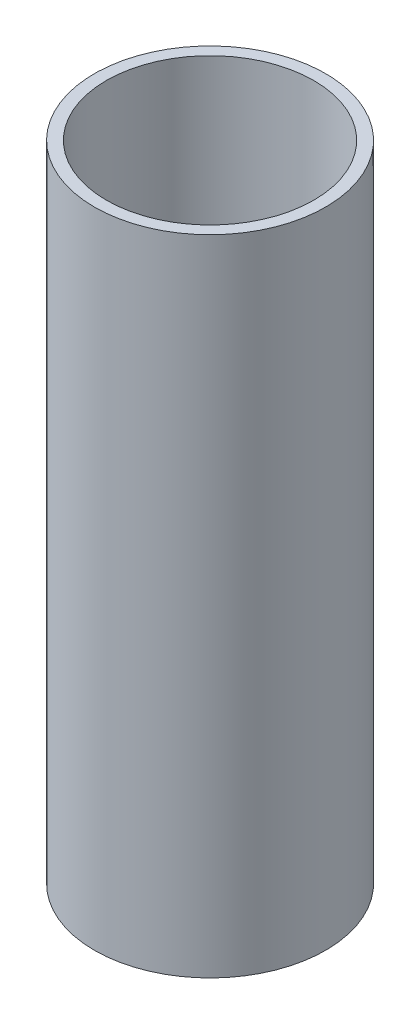
ISO-10303-21;
HEADER;
FILE_DESCRIPTION(('STEP AP214'),'2;1');
FILE_NAME('part.step','',(''),(''),'','','');
FILE_SCHEMA(('AUTOMOTIVE_DESIGN { 1 0 10303 214 1 1 1 1 }'));
ENDSEC;
DATA;
#1=APPLICATION_CONTEXT('core data for automotive mechanical design processes');
#2=APPLICATION_PROTOCOL_DEFINITION('international standard','automotive_design',2000,#1);
#3=PRODUCT_CONTEXT('',#1,'mechanical');
#4=PRODUCT('Part','Part','',(#3));
#5=PRODUCT_RELATED_PRODUCT_CATEGORY('part','',(#4));
#6=PRODUCT_DEFINITION_FORMATION('','',#4);
#7=PRODUCT_DEFINITION_CONTEXT('part definition',#1,'design');
#8=PRODUCT_DEFINITION('design','',#6,#7);
#9=PRODUCT_DEFINITION_SHAPE('','',#8);
#10=(LENGTH_UNIT() NAMED_UNIT(*) SI_UNIT(.MILLI.,.METRE.));
#11=(NAMED_UNIT(*) PLANE_ANGLE_UNIT() SI_UNIT($,.RADIAN.));
#12=(NAMED_UNIT(*) SI_UNIT($,.STERADIAN.) SOLID_ANGLE_UNIT());
#13=UNCERTAINTY_MEASURE_WITH_UNIT(LENGTH_MEASURE(1.E-05),#10,'distance_accuracy_value','');
#14=(GEOMETRIC_REPRESENTATION_CONTEXT(3) GLOBAL_UNCERTAINTY_ASSIGNED_CONTEXT((#13)) GLOBAL_UNIT_ASSIGNED_CONTEXT((#10,
#11,#12)) REPRESENTATION_CONTEXT('',''));
#15=CARTESIAN_POINT('',(0.,0.,0.));
#16=DIRECTION('',(0.,0.,1.));
#17=DIRECTION('',(1.,0.,0.));
#18=AXIS2_PLACEMENT_3D('',#15,#16,#17);
#19=CARTESIAN_POINT('',(0.,306.200191863383,0.));
#20=DIRECTION('',(0.,-1.,0.));
#21=DIRECTION('',(0.,0.,-1.));
#22=AXIS2_PLACEMENT_3D('',#19,#20,#21);
#23=CYLINDRICAL_SURFACE('',#22,55.);
#24=CARTESIAN_POINT('',(0.,306.200191863383,0.));
#25=DIRECTION('',(0.,1.,0.));
#26=DIRECTION('',(0.,0.,1.));
#27=AXIS2_PLACEMENT_3D('',#24,#25,#26);
#28=CIRCLE('',#27,55.);
#29=CARTESIAN_POINT('',(0.,306.200191863383,55.));
#30=VERTEX_POINT('',#29);
#31=EDGE_CURVE('E10',#30,#30,#28,.T.);
#32=ORIENTED_EDGE('',*,*,#31,.F.);
#33=EDGE_LOOP('',(#32));
#34=FACE_BOUND('',#33,.T.);
#35=CARTESIAN_POINT('',(0.,0.,0.));
#36=DIRECTION('',(0.,1.,0.));
#37=DIRECTION('',(0.,0.,1.));
#38=AXIS2_PLACEMENT_3D('',#35,#36,#37);
#39=CIRCLE('',#38,55.);
#40=CARTESIAN_POINT('',(0.,0.,55.));
#41=VERTEX_POINT('',#40);
#42=EDGE_CURVE('E37',#41,#41,#39,.T.);
#43=ORIENTED_EDGE('',*,*,#42,.T.);
#44=EDGE_LOOP('',(#43));
#45=FACE_BOUND('',#44,.T.);
#46=ADVANCED_FACE('F40',(#34,#45),#23,.T.);
#47=CARTESIAN_POINT('',(0.,306.200191863383,0.));
#48=DIRECTION('',(0.,1.,0.));
#49=DIRECTION('',(0.,0.,1.));
#50=AXIS2_PLACEMENT_3D('',#47,#48,#49);
#51=PLANE('',#50);
#52=CARTESIAN_POINT('',(0.,306.200191863383,0.));
#53=DIRECTION('',(0.,1.,0.));
#54=DIRECTION('',(0.,0.,1.));
#55=AXIS2_PLACEMENT_3D('',#52,#53,#54);
#56=CIRCLE('',#55,49.3352893261121);
#57=CARTESIAN_POINT('',(0.,306.200191863383,49.3352893261121));
#58=VERTEX_POINT('',#57);
#59=EDGE_CURVE('E50',#58,#58,#56,.T.);
#60=ORIENTED_EDGE('',*,*,#59,.F.);
#61=EDGE_LOOP('',(#60));
#62=FACE_BOUND('',#61,.T.);
#63=ORIENTED_EDGE('',*,*,#31,.T.);
#64=EDGE_LOOP('',(#63));
#65=FACE_BOUND('',#64,.T.);
#66=ADVANCED_FACE('F59',(#62,#65),#51,.T.);
#67=CARTESIAN_POINT('',(0.,0.,0.));
#68=DIRECTION('',(0.,1.,0.));
#69=DIRECTION('',(0.,0.,1.));
#70=AXIS2_PLACEMENT_3D('',#67,#68,#69);
#71=PLANE('',#70);
#72=CARTESIAN_POINT('',(0.,0.,0.));
#73=DIRECTION('',(0.,1.,0.));
#74=DIRECTION('',(0.,0.,1.));
#75=AXIS2_PLACEMENT_3D('',#72,#73,#74);
#76=CIRCLE('',#75,49.3352893261121);
#77=CARTESIAN_POINT('',(0.,0.,49.3352893261121));
#78=VERTEX_POINT('',#77);
#79=EDGE_CURVE('E47',#78,#78,#76,.T.);
#80=ORIENTED_EDGE('',*,*,#79,.T.);
#81=EDGE_LOOP('',(#80));
#82=FACE_BOUND('',#81,.T.);
#83=ORIENTED_EDGE('',*,*,#42,.F.);
#84=EDGE_LOOP('',(#83));
#85=FACE_BOUND('',#84,.T.);
#86=ADVANCED_FACE('F58',(#82,#85),#71,.F.);
#87=CARTESIAN_POINT('',(0.,306.200191863383,0.));
#88=DIRECTION('',(0.,-1.,0.));
#89=DIRECTION('',(0.,0.,-1.));
#90=AXIS2_PLACEMENT_3D('',#87,#88,#89);
#91=CYLINDRICAL_SURFACE('',#90,49.3352893261121);
#92=ORIENTED_EDGE('',*,*,#59,.T.);
#93=EDGE_LOOP('',(#92));
#94=FACE_BOUND('',#93,.T.);
#95=ORIENTED_EDGE('',*,*,#79,.F.);
#96=EDGE_LOOP('',(#95));
#97=FACE_BOUND('',#96,.T.);
#98=ADVANCED_FACE('F54',(#94,#97),#91,.F.);
#99=CLOSED_SHELL('',(#46,#66,#86,#98));
#100=MANIFOLD_SOLID_BREP('B2',#99);
#101=ADVANCED_BREP_SHAPE_REPRESENTATION('',(#18,#100),#14);
#102=SHAPE_DEFINITION_REPRESENTATION(#9,#101);
ENDSEC;
END-ISO-10303-21;
